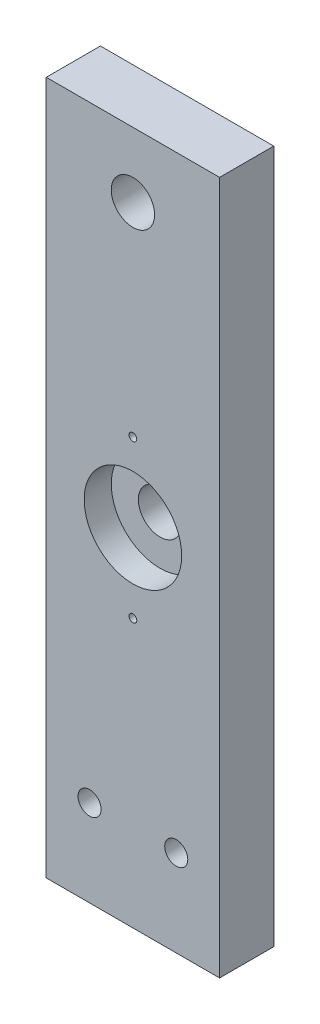
ISO-10303-21;
HEADER;
FILE_DESCRIPTION(('STEP AP214'),'2;1');
FILE_NAME('part.step','',(''),(''),'','','');
FILE_SCHEMA(('AUTOMOTIVE_DESIGN { 1 0 10303 214 1 1 1 1 }'));
ENDSEC;
DATA;
#1=APPLICATION_CONTEXT('core data for automotive mechanical design processes');
#2=APPLICATION_PROTOCOL_DEFINITION('international standard','automotive_design',2000,#1);
#3=PRODUCT_CONTEXT('',#1,'mechanical');
#4=PRODUCT('Part','Part','',(#3));
#5=PRODUCT_RELATED_PRODUCT_CATEGORY('part','',(#4));
#6=PRODUCT_DEFINITION_FORMATION('','',#4);
#7=PRODUCT_DEFINITION_CONTEXT('part definition',#1,'design');
#8=PRODUCT_DEFINITION('design','',#6,#7);
#9=PRODUCT_DEFINITION_SHAPE('','',#8);
#10=(LENGTH_UNIT() NAMED_UNIT(*) SI_UNIT(.MILLI.,.METRE.));
#11=(NAMED_UNIT(*) PLANE_ANGLE_UNIT() SI_UNIT($,.RADIAN.));
#12=(NAMED_UNIT(*) SI_UNIT($,.STERADIAN.) SOLID_ANGLE_UNIT());
#13=UNCERTAINTY_MEASURE_WITH_UNIT(LENGTH_MEASURE(1.E-05),#10,'distance_accuracy_value','');
#14=(GEOMETRIC_REPRESENTATION_CONTEXT(3) GLOBAL_UNCERTAINTY_ASSIGNED_CONTEXT((#13)) GLOBAL_UNIT_ASSIGNED_CONTEXT((#10,
#11,#12)) REPRESENTATION_CONTEXT('',''));
#15=CARTESIAN_POINT('',(0.,0.,0.));
#16=DIRECTION('',(0.,0.,1.));
#17=DIRECTION('',(1.,0.,0.));
#18=AXIS2_PLACEMENT_3D('',#15,#16,#17);
#19=CARTESIAN_POINT('',(0.,76.2,15.875));
#20=DIRECTION('',(0.,0.,-1.));
#21=DIRECTION('',(-1.,0.,0.));
#22=AXIS2_PLACEMENT_3D('',#19,#20,#21);
#23=CYLINDRICAL_SURFACE('',#22,6.35);
#24=CARTESIAN_POINT('',(0.,76.2,0.));
#25=DIRECTION('',(0.,0.,-1.));
#26=DIRECTION('',(-1.,0.,0.));
#27=AXIS2_PLACEMENT_3D('',#24,#25,#26);
#28=CIRCLE('',#27,6.35);
#29=CARTESIAN_POINT('',(-6.35,76.2,0.));
#30=VERTEX_POINT('',#29);
#31=EDGE_CURVE('E123',#30,#30,#28,.T.);
#32=ORIENTED_EDGE('',*,*,#31,.T.);
#33=EDGE_LOOP('',(#32));
#34=FACE_BOUND('',#33,.T.);
#35=CARTESIAN_POINT('',(0.,76.2,7.9375));
#36=DIRECTION('',(0.,0.,1.));
#37=DIRECTION('',(1.,0.,0.));
#38=AXIS2_PLACEMENT_3D('',#35,#36,#37);
#39=CIRCLE('',#38,6.35);
#40=CARTESIAN_POINT('',(6.35,76.2,7.9375));
#41=VERTEX_POINT('',#40);
#42=EDGE_CURVE('E41',#41,#41,#39,.F.);
#43=ORIENTED_EDGE('',*,*,#42,.F.);
#44=EDGE_LOOP('',(#43));
#45=FACE_BOUND('',#44,.T.);
#46=ADVANCED_FACE('F37',(#34,#45),#23,.F.);
#47=CARTESIAN_POINT('',(-25.4,-25.4,15.875));
#48=DIRECTION('',(0.,1.,0.));
#49=DIRECTION('',(0.,0.,1.));
#50=AXIS2_PLACEMENT_3D('',#47,#48,#49);
#51=PLANE('',#50);
#52=DIRECTION('',(1.,0.,0.));
#53=VECTOR('',#52,1.);
#54=CARTESIAN_POINT('',(-25.4,-25.4,0.));
#55=LINE('',#54,#53);
#56=CARTESIAN_POINT('',(-25.4,-25.4,0.));
#57=VERTEX_POINT('',#56);
#58=CARTESIAN_POINT('',(25.4,-25.4,0.));
#59=VERTEX_POINT('',#58);
#60=EDGE_CURVE('E137',#57,#59,#55,.T.);
#61=ORIENTED_EDGE('',*,*,#60,.T.);
#62=DIRECTION('',(0.,0.,-1.));
#63=VECTOR('',#62,1.);
#64=CARTESIAN_POINT('',(25.4,-25.4,15.875));
#65=LINE('',#64,#63);
#66=CARTESIAN_POINT('',(25.4,-25.4,15.875));
#67=VERTEX_POINT('',#66);
#68=EDGE_CURVE('E11',#67,#59,#65,.T.);
#69=ORIENTED_EDGE('',*,*,#68,.F.);
#70=DIRECTION('',(1.,0.,0.));
#71=VECTOR('',#70,1.);
#72=CARTESIAN_POINT('',(-25.4,-25.4,15.875));
#73=LINE('',#72,#71);
#74=CARTESIAN_POINT('',(-25.4,-25.4,15.875));
#75=VERTEX_POINT('',#74);
#76=EDGE_CURVE('E138',#75,#67,#73,.T.);
#77=ORIENTED_EDGE('',*,*,#76,.F.);
#78=DIRECTION('',(0.,0.,-1.));
#79=VECTOR('',#78,1.);
#80=CARTESIAN_POINT('',(-25.4,-25.4,15.875));
#81=LINE('',#80,#79);
#82=EDGE_CURVE('E55',#75,#57,#81,.T.);
#83=ORIENTED_EDGE('',*,*,#82,.T.);
#84=EDGE_LOOP('',(#61,#69,#77,#83));
#85=FACE_BOUND('',#84,.T.);
#86=ADVANCED_FACE('F39',(#85),#51,.F.);
#87=CARTESIAN_POINT('',(25.4,-25.4,15.875));
#88=DIRECTION('',(-1.,0.,0.));
#89=DIRECTION('',(0.,0.,1.));
#90=AXIS2_PLACEMENT_3D('',#87,#88,#89);
#91=PLANE('',#90);
#92=DIRECTION('',(0.,1.,0.));
#93=VECTOR('',#92,1.);
#94=CARTESIAN_POINT('',(25.4,-25.4,0.));
#95=LINE('',#94,#93);
#96=CARTESIAN_POINT('',(25.4,177.8,0.));
#97=VERTEX_POINT('',#96);
#98=EDGE_CURVE('E148',#59,#97,#95,.T.);
#99=ORIENTED_EDGE('',*,*,#98,.T.);
#100=DIRECTION('',(0.,0.,-1.));
#101=VECTOR('',#100,1.);
#102=CARTESIAN_POINT('',(25.4,177.8,15.875));
#103=LINE('',#102,#101);
#104=CARTESIAN_POINT('',(25.4,177.8,15.875));
#105=VERTEX_POINT('',#104);
#106=EDGE_CURVE('E47',#105,#97,#103,.T.);
#107=ORIENTED_EDGE('',*,*,#106,.F.);
#108=DIRECTION('',(0.,1.,0.));
#109=VECTOR('',#108,1.);
#110=CARTESIAN_POINT('',(25.4,-25.4,15.875));
#111=LINE('',#110,#109);
#112=EDGE_CURVE('E81',#67,#105,#111,.T.);
#113=ORIENTED_EDGE('',*,*,#112,.F.);
#114=ORIENTED_EDGE('',*,*,#68,.T.);
#115=EDGE_LOOP('',(#99,#107,#113,#114));
#116=FACE_BOUND('',#115,.T.);
#117=ADVANCED_FACE('F161',(#116),#91,.F.);
#118=CARTESIAN_POINT('',(-25.4,177.8,15.875));
#119=DIRECTION('',(0.,1.,0.));
#120=DIRECTION('',(-1.,0.,0.));
#121=AXIS2_PLACEMENT_3D('',#118,#119,#120);
#122=PLANE('',#121);
#123=DIRECTION('',(1.,0.,0.));
#124=VECTOR('',#123,1.);
#125=CARTESIAN_POINT('',(-25.4,177.8,0.));
#126=LINE('',#125,#124);
#127=CARTESIAN_POINT('',(-25.4,177.8,0.));
#128=VERTEX_POINT('',#127);
#129=EDGE_CURVE('E151',#128,#97,#126,.T.);
#130=ORIENTED_EDGE('',*,*,#129,.F.);
#131=DIRECTION('',(0.,0.,-1.));
#132=VECTOR('',#131,1.);
#133=CARTESIAN_POINT('',(-25.4,177.8,15.875));
#134=LINE('',#133,#132);
#135=CARTESIAN_POINT('',(-25.4,177.8,15.875));
#136=VERTEX_POINT('',#135);
#137=EDGE_CURVE('E70',#136,#128,#134,.T.);
#138=ORIENTED_EDGE('',*,*,#137,.F.);
#139=DIRECTION('',(1.,0.,0.));
#140=VECTOR('',#139,1.);
#141=CARTESIAN_POINT('',(-25.4,177.8,15.875));
#142=LINE('',#141,#140);
#143=EDGE_CURVE('E142',#136,#105,#142,.T.);
#144=ORIENTED_EDGE('',*,*,#143,.T.);
#145=ORIENTED_EDGE('',*,*,#106,.T.);
#146=EDGE_LOOP('',(#130,#138,#144,#145));
#147=FACE_BOUND('',#146,.T.);
#148=ADVANCED_FACE('F159',(#147),#122,.T.);
#149=CARTESIAN_POINT('',(-25.4,-25.4,15.875));
#150=DIRECTION('',(-1.,0.,0.));
#151=DIRECTION('',(0.,0.,1.));
#152=AXIS2_PLACEMENT_3D('',#149,#150,#151);
#153=PLANE('',#152);
#154=DIRECTION('',(0.,1.,0.));
#155=VECTOR('',#154,1.);
#156=CARTESIAN_POINT('',(-25.4,-25.4,0.));
#157=LINE('',#156,#155);
#158=EDGE_CURVE('E140',#57,#128,#157,.T.);
#159=ORIENTED_EDGE('',*,*,#158,.F.);
#160=ORIENTED_EDGE('',*,*,#82,.F.);
#161=DIRECTION('',(0.,1.,0.));
#162=VECTOR('',#161,1.);
#163=CARTESIAN_POINT('',(-25.4,-25.4,15.875));
#164=LINE('',#163,#162);
#165=EDGE_CURVE('E145',#75,#136,#164,.T.);
#166=ORIENTED_EDGE('',*,*,#165,.T.);
#167=ORIENTED_EDGE('',*,*,#137,.T.);
#168=EDGE_LOOP('',(#159,#160,#166,#167));
#169=FACE_BOUND('',#168,.T.);
#170=ADVANCED_FACE('F165',(#169),#153,.T.);
#171=CARTESIAN_POINT('',(0.,0.,15.875));
#172=DIRECTION('',(0.,0.,1.));
#173=DIRECTION('',(1.,0.,0.));
#174=AXIS2_PLACEMENT_3D('',#171,#172,#173);
#175=PLANE('',#174);
#176=CARTESIAN_POINT('',(0.,99.187,15.875));
#177=DIRECTION('',(0.,0.,1.));
#178=DIRECTION('',(1.,0.,0.));
#179=AXIS2_PLACEMENT_3D('',#176,#177,#178);
#180=CIRCLE('',#179,1.13029999999999);
#181=CARTESIAN_POINT('',(1.13029999999998,99.187,15.875));
#182=VERTEX_POINT('',#181);
#183=EDGE_CURVE('E100',#182,#182,#180,.T.);
#184=ORIENTED_EDGE('',*,*,#183,.F.);
#185=EDGE_LOOP('',(#184));
#186=FACE_BOUND('',#185,.T.);
#187=CARTESIAN_POINT('',(0.,53.213,15.875));
#188=DIRECTION('',(0.,0.,1.));
#189=DIRECTION('',(1.,0.,0.));
#190=AXIS2_PLACEMENT_3D('',#187,#188,#189);
#191=CIRCLE('',#190,1.13029999999999);
#192=CARTESIAN_POINT('',(1.13029999999999,53.213,15.875));
#193=VERTEX_POINT('',#192);
#194=EDGE_CURVE('E99',#193,#193,#191,.T.);
#195=ORIENTED_EDGE('',*,*,#194,.F.);
#196=EDGE_LOOP('',(#195));
#197=FACE_BOUND('',#196,.T.);
#198=CARTESIAN_POINT('',(0.,76.2,15.875));
#199=DIRECTION('',(0.,0.,1.));
#200=DIRECTION('',(1.,0.,0.));
#201=AXIS2_PLACEMENT_3D('',#198,#199,#200);
#202=CIRCLE('',#201,14.2875);
#203=CARTESIAN_POINT('',(14.2875,76.2,15.875));
#204=VERTEX_POINT('',#203);
#205=EDGE_CURVE('E110',#204,#204,#202,.T.);
#206=ORIENTED_EDGE('',*,*,#205,.F.);
#207=EDGE_LOOP('',(#206));
#208=FACE_BOUND('',#207,.T.);
#209=CARTESIAN_POINT('',(0.,158.75,15.875));
#210=DIRECTION('',(0.,0.,-1.));
#211=DIRECTION('',(-1.,0.,0.));
#212=AXIS2_PLACEMENT_3D('',#209,#210,#211);
#213=CIRCLE('',#212,6.34999999999999);
#214=CARTESIAN_POINT('',(-6.34999999999999,158.75,15.875));
#215=VERTEX_POINT('',#214);
#216=EDGE_CURVE('E116',#215,#215,#213,.T.);
#217=ORIENTED_EDGE('',*,*,#216,.T.);
#218=EDGE_LOOP('',(#217));
#219=FACE_BOUND('',#218,.T.);
#220=CARTESIAN_POINT('',(12.7,0.,15.875));
#221=DIRECTION('',(0.,0.,1.));
#222=DIRECTION('',(1.,0.,0.));
#223=AXIS2_PLACEMENT_3D('',#220,#221,#222);
#224=CIRCLE('',#223,3.3782);
#225=CARTESIAN_POINT('',(16.0782,0.,15.875));
#226=VERTEX_POINT('',#225);
#227=EDGE_CURVE('E119',#226,#226,#224,.T.);
#228=ORIENTED_EDGE('',*,*,#227,.F.);
#229=EDGE_LOOP('',(#228));
#230=FACE_BOUND('',#229,.T.);
#231=CARTESIAN_POINT('',(-12.7,0.,15.875));
#232=DIRECTION('',(0.,0.,1.));
#233=DIRECTION('',(1.,0.,0.));
#234=AXIS2_PLACEMENT_3D('',#231,#232,#233);
#235=CIRCLE('',#234,3.3782);
#236=CARTESIAN_POINT('',(-9.3218,0.,15.875));
#237=VERTEX_POINT('',#236);
#238=EDGE_CURVE('E131',#237,#237,#235,.T.);
#239=ORIENTED_EDGE('',*,*,#238,.F.);
#240=EDGE_LOOP('',(#239));
#241=FACE_BOUND('',#240,.T.);
#242=ORIENTED_EDGE('',*,*,#76,.T.);
#243=ORIENTED_EDGE('',*,*,#112,.T.);
#244=ORIENTED_EDGE('',*,*,#143,.F.);
#245=ORIENTED_EDGE('',*,*,#165,.F.);
#246=EDGE_LOOP('',(#242,#243,#244,#245));
#247=FACE_BOUND('',#246,.T.);
#248=ADVANCED_FACE('F167',(#186,#197,#208,#219,#230,#241,#247),#175,.T.);
#249=CARTESIAN_POINT('',(0.,0.,0.));
#250=DIRECTION('',(0.,0.,1.));
#251=DIRECTION('',(1.,0.,0.));
#252=AXIS2_PLACEMENT_3D('',#249,#250,#251);
#253=PLANE('',#252);
#254=CARTESIAN_POINT('',(0.,158.75,0.));
#255=DIRECTION('',(0.,0.,-1.));
#256=DIRECTION('',(-1.,0.,0.));
#257=AXIS2_PLACEMENT_3D('',#254,#255,#256);
#258=CIRCLE('',#257,6.34999999999999);
#259=CARTESIAN_POINT('',(-6.34999999999999,158.75,0.));
#260=VERTEX_POINT('',#259);
#261=EDGE_CURVE('E120',#260,#260,#258,.T.);
#262=ORIENTED_EDGE('',*,*,#261,.F.);
#263=EDGE_LOOP('',(#262));
#264=FACE_BOUND('',#263,.T.);
#265=ORIENTED_EDGE('',*,*,#31,.F.);
#266=EDGE_LOOP('',(#265));
#267=FACE_BOUND('',#266,.T.);
#268=CARTESIAN_POINT('',(12.7,0.,0.));
#269=DIRECTION('',(0.,0.,1.));
#270=DIRECTION('',(1.,0.,0.));
#271=AXIS2_PLACEMENT_3D('',#268,#269,#270);
#272=CIRCLE('',#271,3.3782);
#273=CARTESIAN_POINT('',(16.0782,0.,0.));
#274=VERTEX_POINT('',#273);
#275=EDGE_CURVE('E128',#274,#274,#272,.T.);
#276=ORIENTED_EDGE('',*,*,#275,.T.);
#277=EDGE_LOOP('',(#276));
#278=FACE_BOUND('',#277,.T.);
#279=CARTESIAN_POINT('',(-12.7,0.,0.));
#280=DIRECTION('',(0.,0.,1.));
#281=DIRECTION('',(1.,0.,0.));
#282=AXIS2_PLACEMENT_3D('',#279,#280,#281);
#283=CIRCLE('',#282,3.3782);
#284=CARTESIAN_POINT('',(-9.3218,0.,0.));
#285=VERTEX_POINT('',#284);
#286=EDGE_CURVE('E134',#285,#285,#283,.T.);
#287=ORIENTED_EDGE('',*,*,#286,.T.);
#288=EDGE_LOOP('',(#287));
#289=FACE_BOUND('',#288,.T.);
#290=ORIENTED_EDGE('',*,*,#60,.F.);
#291=ORIENTED_EDGE('',*,*,#158,.T.);
#292=ORIENTED_EDGE('',*,*,#129,.T.);
#293=ORIENTED_EDGE('',*,*,#98,.F.);
#294=EDGE_LOOP('',(#290,#291,#292,#293));
#295=FACE_BOUND('',#294,.T.);
#296=ADVANCED_FACE('F164',(#264,#267,#278,#289,#295),#253,.F.);
#297=CARTESIAN_POINT('',(-12.7,0.,15.875));
#298=DIRECTION('',(0.,0.,1.));
#299=DIRECTION('',(1.,0.,0.));
#300=AXIS2_PLACEMENT_3D('',#297,#298,#299);
#301=CYLINDRICAL_SURFACE('',#300,3.3782);
#302=ORIENTED_EDGE('',*,*,#286,.F.);
#303=EDGE_LOOP('',(#302));
#304=FACE_BOUND('',#303,.T.);
#305=ORIENTED_EDGE('',*,*,#238,.T.);
#306=EDGE_LOOP('',(#305));
#307=FACE_BOUND('',#306,.T.);
#308=ADVANCED_FACE('F191',(#304,#307),#301,.F.);
#309=CARTESIAN_POINT('',(12.7,0.,15.875));
#310=DIRECTION('',(0.,0.,1.));
#311=DIRECTION('',(1.,0.,0.));
#312=AXIS2_PLACEMENT_3D('',#309,#310,#311);
#313=CYLINDRICAL_SURFACE('',#312,3.3782);
#314=ORIENTED_EDGE('',*,*,#275,.F.);
#315=EDGE_LOOP('',(#314));
#316=FACE_BOUND('',#315,.T.);
#317=ORIENTED_EDGE('',*,*,#227,.T.);
#318=EDGE_LOOP('',(#317));
#319=FACE_BOUND('',#318,.T.);
#320=ADVANCED_FACE('F188',(#316,#319),#313,.F.);
#321=CARTESIAN_POINT('',(0.,158.75,15.875));
#322=DIRECTION('',(0.,0.,-1.));
#323=DIRECTION('',(-1.,0.,0.));
#324=AXIS2_PLACEMENT_3D('',#321,#322,#323);
#325=CYLINDRICAL_SURFACE('',#324,6.34999999999999);
#326=ORIENTED_EDGE('',*,*,#216,.F.);
#327=EDGE_LOOP('',(#326));
#328=FACE_BOUND('',#327,.T.);
#329=ORIENTED_EDGE('',*,*,#261,.T.);
#330=EDGE_LOOP('',(#329));
#331=FACE_BOUND('',#330,.T.);
#332=ADVANCED_FACE('F186',(#328,#331),#325,.F.);
#333=CARTESIAN_POINT('',(0.,76.2,7.9375));
#334=DIRECTION('',(0.,0.,1.));
#335=DIRECTION('',(1.,0.,0.));
#336=AXIS2_PLACEMENT_3D('',#333,#334,#335);
#337=PLANE('',#336);
#338=CARTESIAN_POINT('',(0.,76.2,7.9375));
#339=DIRECTION('',(0.,0.,1.));
#340=DIRECTION('',(1.,0.,0.));
#341=AXIS2_PLACEMENT_3D('',#338,#339,#340);
#342=CIRCLE('',#341,14.2875);
#343=CARTESIAN_POINT('',(14.2875,76.2,7.9375));
#344=VERTEX_POINT('',#343);
#345=EDGE_CURVE('E111',#344,#344,#342,.T.);
#346=ORIENTED_EDGE('',*,*,#345,.T.);
#347=EDGE_LOOP('',(#346));
#348=FACE_BOUND('',#347,.T.);
#349=ORIENTED_EDGE('',*,*,#42,.T.);
#350=EDGE_LOOP('',(#349));
#351=FACE_BOUND('',#350,.T.);
#352=ADVANCED_FACE('F216',(#348,#351),#337,.T.);
#353=CARTESIAN_POINT('',(0.,76.2,7.9375));
#354=DIRECTION('',(0.,0.,1.));
#355=DIRECTION('',(1.,0.,0.));
#356=AXIS2_PLACEMENT_3D('',#353,#354,#355);
#357=CYLINDRICAL_SURFACE('',#356,14.2875);
#358=ORIENTED_EDGE('',*,*,#345,.F.);
#359=EDGE_LOOP('',(#358));
#360=FACE_BOUND('',#359,.T.);
#361=ORIENTED_EDGE('',*,*,#205,.T.);
#362=EDGE_LOOP('',(#361));
#363=FACE_BOUND('',#362,.T.);
#364=ADVANCED_FACE('F221',(#360,#363),#357,.F.);
#365=CARTESIAN_POINT('',(0.,53.213,8.255));
#366=DIRECTION('',(0.,0.,1.));
#367=DIRECTION('',(1.,0.,0.));
#368=AXIS2_PLACEMENT_3D('',#365,#366,#367);
#369=CONICAL_SURFACE('',#368,1.13029999999999,1.02974425867665);
#370=CARTESIAN_POINT('',(0.,53.213,7.57584724231315));
#371=VERTEX_POINT('',#370);
#372=VERTEX_LOOP('',#371);
#373=FACE_BOUND('',#372,.T.);
#374=CARTESIAN_POINT('',(0.,53.213,8.255));
#375=DIRECTION('',(0.,0.,1.));
#376=DIRECTION('',(1.,0.,0.));
#377=AXIS2_PLACEMENT_3D('',#374,#375,#376);
#378=CIRCLE('',#377,1.13029999999999);
#379=CARTESIAN_POINT('',(1.13029999999999,53.213,8.255));
#380=VERTEX_POINT('',#379);
#381=EDGE_CURVE('E103',#380,#380,#378,.T.);
#382=ORIENTED_EDGE('',*,*,#381,.T.);
#383=EDGE_LOOP('',(#382));
#384=FACE_BOUND('',#383,.T.);
#385=ADVANCED_FACE('F229',(#373,#384),#369,.F.);
#386=CARTESIAN_POINT('',(0.,53.213,15.875));
#387=DIRECTION('',(0.,0.,1.));
#388=DIRECTION('',(1.,0.,0.));
#389=AXIS2_PLACEMENT_3D('',#386,#387,#388);
#390=CYLINDRICAL_SURFACE('',#389,1.13029999999999);
#391=ORIENTED_EDGE('',*,*,#381,.F.);
#392=EDGE_LOOP('',(#391));
#393=FACE_BOUND('',#392,.T.);
#394=ORIENTED_EDGE('',*,*,#194,.T.);
#395=EDGE_LOOP('',(#394));
#396=FACE_BOUND('',#395,.T.);
#397=ADVANCED_FACE('F93',(#393,#396),#390,.F.);
#398=CARTESIAN_POINT('',(0.,99.187,8.255));
#399=DIRECTION('',(0.,0.,1.));
#400=DIRECTION('',(1.,0.,0.));
#401=AXIS2_PLACEMENT_3D('',#398,#399,#400);
#402=CONICAL_SURFACE('',#401,1.13029999999999,1.02974425867665);
#403=CARTESIAN_POINT('',(0.,99.187,7.57584724231315));
#404=VERTEX_POINT('',#403);
#405=VERTEX_LOOP('',#404);
#406=FACE_BOUND('',#405,.T.);
#407=CARTESIAN_POINT('',(0.,99.187,8.255));
#408=DIRECTION('',(0.,0.,1.));
#409=DIRECTION('',(1.,0.,0.));
#410=AXIS2_PLACEMENT_3D('',#407,#408,#409);
#411=CIRCLE('',#410,1.13029999999999);
#412=CARTESIAN_POINT('',(1.13029999999998,99.187,8.255));
#413=VERTEX_POINT('',#412);
#414=EDGE_CURVE('E97',#413,#413,#411,.T.);
#415=ORIENTED_EDGE('',*,*,#414,.T.);
#416=EDGE_LOOP('',(#415));
#417=FACE_BOUND('',#416,.T.);
#418=ADVANCED_FACE('F89',(#406,#417),#402,.F.);
#419=CARTESIAN_POINT('',(0.,99.187,15.875));
#420=DIRECTION('',(0.,0.,1.));
#421=DIRECTION('',(1.,0.,0.));
#422=AXIS2_PLACEMENT_3D('',#419,#420,#421);
#423=CYLINDRICAL_SURFACE('',#422,1.13029999999999);
#424=ORIENTED_EDGE('',*,*,#414,.F.);
#425=EDGE_LOOP('',(#424));
#426=FACE_BOUND('',#425,.T.);
#427=ORIENTED_EDGE('',*,*,#183,.T.);
#428=EDGE_LOOP('',(#427));
#429=FACE_BOUND('',#428,.T.);
#430=ADVANCED_FACE('F92',(#426,#429),#423,.F.);
#431=CLOSED_SHELL('',(#46,#86,#117,#148,#170,#248,#296,#308,#320,#332,#352,#364,#385,#397,#418,#430));
#432=MANIFOLD_SOLID_BREP('B2',#431);
#433=ADVANCED_BREP_SHAPE_REPRESENTATION('',(#18,#432),#14);
#434=SHAPE_DEFINITION_REPRESENTATION(#9,#433);
ENDSEC;
END-ISO-10303-21;
